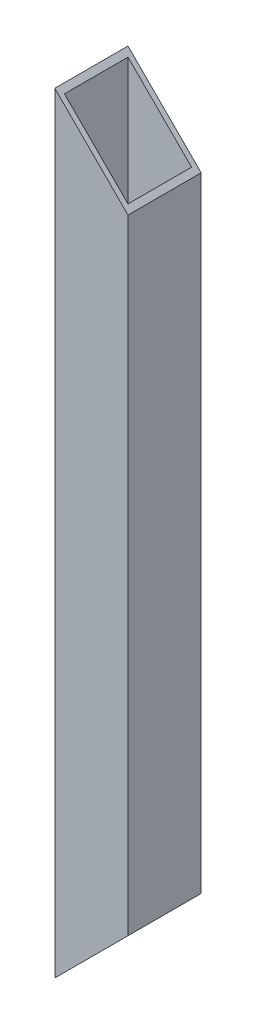
ISO-10303-21;
HEADER;
FILE_DESCRIPTION(('STEP AP214'),'2;1');
FILE_NAME('part.step','',(''),(''),'','','');
FILE_SCHEMA(('AUTOMOTIVE_DESIGN { 1 0 10303 214 1 1 1 1 }'));
ENDSEC;
DATA;
#1=APPLICATION_CONTEXT('core data for automotive mechanical design processes');
#2=APPLICATION_PROTOCOL_DEFINITION('international standard','automotive_design',2000,#1);
#3=PRODUCT_CONTEXT('',#1,'mechanical');
#4=PRODUCT('Part','Part','',(#3));
#5=PRODUCT_RELATED_PRODUCT_CATEGORY('part','',(#4));
#6=PRODUCT_DEFINITION_FORMATION('','',#4);
#7=PRODUCT_DEFINITION_CONTEXT('part definition',#1,'design');
#8=PRODUCT_DEFINITION('design','',#6,#7);
#9=PRODUCT_DEFINITION_SHAPE('','',#8);
#10=(LENGTH_UNIT() NAMED_UNIT(*) SI_UNIT(.MILLI.,.METRE.));
#11=(NAMED_UNIT(*) PLANE_ANGLE_UNIT() SI_UNIT($,.RADIAN.));
#12=(NAMED_UNIT(*) SI_UNIT($,.STERADIAN.) SOLID_ANGLE_UNIT());
#13=UNCERTAINTY_MEASURE_WITH_UNIT(LENGTH_MEASURE(1.E-05),#10,'distance_accuracy_value','');
#14=(GEOMETRIC_REPRESENTATION_CONTEXT(3) GLOBAL_UNCERTAINTY_ASSIGNED_CONTEXT((#13)) GLOBAL_UNIT_ASSIGNED_CONTEXT((#10,
#11,#12)) REPRESENTATION_CONTEXT('',''));
#15=CARTESIAN_POINT('',(0.,0.,0.));
#16=DIRECTION('',(0.,0.,1.));
#17=DIRECTION('',(1.,0.,0.));
#18=AXIS2_PLACEMENT_3D('',#15,#16,#17);
#19=CARTESIAN_POINT('',(19.,400.,-19.));
#20=DIRECTION('',(1.,0.,0.));
#21=DIRECTION('',(0.,0.,-1.));
#22=AXIS2_PLACEMENT_3D('',#19,#20,#21);
#23=PLANE('',#22);
#24=DIRECTION('',(0.,0.,1.));
#25=VECTOR('',#24,1.);
#26=CARTESIAN_POINT('',(19.,362.,-384.593855255503));
#27=LINE('',#26,#25);
#28=CARTESIAN_POINT('',(19.,362.,-19.));
#29=VERTEX_POINT('',#28);
#30=CARTESIAN_POINT('',(19.,362.,19.));
#31=VERTEX_POINT('',#30);
#32=EDGE_CURVE('E97',#29,#31,#27,.T.);
#33=ORIENTED_EDGE('',*,*,#32,.T.);
#34=DIRECTION('',(0.,-1.,0.));
#35=VECTOR('',#34,1.);
#36=CARTESIAN_POINT('',(19.,400.,19.));
#37=LINE('',#36,#35);
#38=CARTESIAN_POINT('',(19.,38.,19.));
#39=VERTEX_POINT('',#38);
#40=EDGE_CURVE('E95',#31,#39,#37,.T.);
#41=ORIENTED_EDGE('',*,*,#40,.T.);
#42=DIRECTION('',(0.,0.,1.));
#43=VECTOR('',#42,1.);
#44=CARTESIAN_POINT('',(19.,38.,-384.593855255503));
#45=LINE('',#44,#43);
#46=CARTESIAN_POINT('',(19.,38.,-19.));
#47=VERTEX_POINT('',#46);
#48=EDGE_CURVE('E137',#47,#39,#45,.T.);
#49=ORIENTED_EDGE('',*,*,#48,.F.);
#50=DIRECTION('',(0.,-1.,0.));
#51=VECTOR('',#50,1.);
#52=CARTESIAN_POINT('',(19.,400.,-19.));
#53=LINE('',#52,#51);
#54=EDGE_CURVE('E85',#29,#47,#53,.T.);
#55=ORIENTED_EDGE('',*,*,#54,.F.);
#56=EDGE_LOOP('',(#33,#41,#49,#55));
#57=FACE_BOUND('',#56,.T.);
#58=ADVANCED_FACE('F17',(#57),#23,.T.);
#59=CARTESIAN_POINT('',(19.,400.,19.));
#60=DIRECTION('',(0.,0.,1.));
#61=DIRECTION('',(1.,0.,0.));
#62=AXIS2_PLACEMENT_3D('',#59,#60,#61);
#63=PLANE('',#62);
#64=DIRECTION('',(0.707106781186547,-0.707106781186548,0.));
#65=VECTOR('',#64,1.);
#66=CARTESIAN_POINT('',(-19.,400.,19.));
#67=LINE('',#66,#65);
#68=CARTESIAN_POINT('',(-19.,400.,19.));
#69=VERTEX_POINT('',#68);
#70=EDGE_CURVE('E31',#69,#31,#67,.T.);
#71=ORIENTED_EDGE('',*,*,#70,.F.);
#72=DIRECTION('',(0.,-1.,0.));
#73=VECTOR('',#72,1.);
#74=CARTESIAN_POINT('',(-19.,400.,19.));
#75=LINE('',#74,#73);
#76=CARTESIAN_POINT('',(-19.,0.,19.));
#77=VERTEX_POINT('',#76);
#78=EDGE_CURVE('E93',#69,#77,#75,.T.);
#79=ORIENTED_EDGE('',*,*,#78,.T.);
#80=DIRECTION('',(0.707106781186547,0.707106781186548,0.));
#81=VECTOR('',#80,1.);
#82=CARTESIAN_POINT('',(-19.,0.,19.));
#83=LINE('',#82,#81);
#84=EDGE_CURVE('E134',#77,#39,#83,.T.);
#85=ORIENTED_EDGE('',*,*,#84,.T.);
#86=ORIENTED_EDGE('',*,*,#40,.F.);
#87=EDGE_LOOP('',(#71,#79,#85,#86));
#88=FACE_BOUND('',#87,.T.);
#89=ADVANCED_FACE('F91',(#88),#63,.T.);
#90=CARTESIAN_POINT('',(-19.,400.,-19.));
#91=DIRECTION('',(0.,0.,-1.));
#92=DIRECTION('',(-1.,0.,0.));
#93=AXIS2_PLACEMENT_3D('',#90,#91,#92);
#94=PLANE('',#93);
#95=DIRECTION('',(-0.707106781186547,0.707106781186548,0.));
#96=VECTOR('',#95,1.);
#97=CARTESIAN_POINT('',(-19.,400.,-19.));
#98=LINE('',#97,#96);
#99=CARTESIAN_POINT('',(-19.,400.,-19.));
#100=VERTEX_POINT('',#99);
#101=EDGE_CURVE('E80',#29,#100,#98,.T.);
#102=ORIENTED_EDGE('',*,*,#101,.F.);
#103=ORIENTED_EDGE('',*,*,#54,.T.);
#104=DIRECTION('',(-0.707106781186547,-0.707106781186548,0.));
#105=VECTOR('',#104,1.);
#106=CARTESIAN_POINT('',(181.,200.,-19.));
#107=LINE('',#106,#105);
#108=CARTESIAN_POINT('',(-19.,0.,-19.));
#109=VERTEX_POINT('',#108);
#110=EDGE_CURVE('E145',#47,#109,#107,.T.);
#111=ORIENTED_EDGE('',*,*,#110,.T.);
#112=DIRECTION('',(0.,-1.,0.));
#113=VECTOR('',#112,1.);
#114=CARTESIAN_POINT('',(-19.,400.,-19.));
#115=LINE('',#114,#113);
#116=EDGE_CURVE('E100',#100,#109,#115,.T.);
#117=ORIENTED_EDGE('',*,*,#116,.F.);
#118=EDGE_LOOP('',(#102,#103,#111,#117));
#119=FACE_BOUND('',#118,.T.);
#120=ADVANCED_FACE('F152',(#119),#94,.T.);
#121=CARTESIAN_POINT('',(-19.,400.,19.));
#122=DIRECTION('',(-1.,0.,0.));
#123=DIRECTION('',(0.,0.,1.));
#124=AXIS2_PLACEMENT_3D('',#121,#122,#123);
#125=PLANE('',#124);
#126=DIRECTION('',(0.,0.,-1.));
#127=VECTOR('',#126,1.);
#128=CARTESIAN_POINT('',(-19.,0.,19.));
#129=LINE('',#128,#127);
#130=EDGE_CURVE('E86',#77,#109,#129,.T.);
#131=ORIENTED_EDGE('',*,*,#130,.F.);
#132=ORIENTED_EDGE('',*,*,#78,.F.);
#133=DIRECTION('',(0.,0.,-1.));
#134=VECTOR('',#133,1.);
#135=CARTESIAN_POINT('',(-19.,400.,19.));
#136=LINE('',#135,#134);
#137=EDGE_CURVE('E77',#69,#100,#136,.T.);
#138=ORIENTED_EDGE('',*,*,#137,.T.);
#139=ORIENTED_EDGE('',*,*,#116,.T.);
#140=EDGE_LOOP('',(#131,#132,#138,#139));
#141=FACE_BOUND('',#140,.T.);
#142=ADVANCED_FACE('F99',(#141),#125,.T.);
#143=CARTESIAN_POINT('',(-19.,0.,-384.593855255503));
#144=DIRECTION('',(0.707106781186548,-0.707106781186547,0.));
#145=DIRECTION('',(0.707106781186547,0.707106781186548,0.));
#146=AXIS2_PLACEMENT_3D('',#143,#144,#145);
#147=PLANE('',#146);
#148=DIRECTION('',(0.707106781186547,0.707106781186548,0.));
#149=VECTOR('',#148,1.);
#150=CARTESIAN_POINT('',(-19.,0.,-16.5));
#151=LINE('',#150,#149);
#152=CARTESIAN_POINT('',(-16.5,2.5,-16.5));
#153=VERTEX_POINT('',#152);
#154=CARTESIAN_POINT('',(16.5,35.5,-16.5));
#155=VERTEX_POINT('',#154);
#156=EDGE_CURVE('E24',#153,#155,#151,.T.);
#157=ORIENTED_EDGE('',*,*,#156,.F.);
#158=DIRECTION('',(0.,0.,-1.));
#159=VECTOR('',#158,1.);
#160=CARTESIAN_POINT('',(-16.5,2.5,-384.593855255503));
#161=LINE('',#160,#159);
#162=CARTESIAN_POINT('',(-16.5,2.5,16.5));
#163=VERTEX_POINT('',#162);
#164=EDGE_CURVE('E102',#163,#153,#161,.T.);
#165=ORIENTED_EDGE('',*,*,#164,.F.);
#166=DIRECTION('',(-0.707106781186547,-0.707106781186548,0.));
#167=VECTOR('',#166,1.);
#168=CARTESIAN_POINT('',(-19.,0.,16.5));
#169=LINE('',#168,#167);
#170=CARTESIAN_POINT('',(16.5,35.5,16.5));
#171=VERTEX_POINT('',#170);
#172=EDGE_CURVE('E109',#171,#163,#169,.T.);
#173=ORIENTED_EDGE('',*,*,#172,.F.);
#174=DIRECTION('',(0.,0.,1.));
#175=VECTOR('',#174,1.);
#176=CARTESIAN_POINT('',(16.5,35.5,-384.593855255503));
#177=LINE('',#176,#175);
#178=EDGE_CURVE('E112',#155,#171,#177,.T.);
#179=ORIENTED_EDGE('',*,*,#178,.F.);
#180=EDGE_LOOP('',(#157,#165,#173,#179));
#181=FACE_BOUND('',#180,.T.);
#182=ORIENTED_EDGE('',*,*,#48,.T.);
#183=ORIENTED_EDGE('',*,*,#84,.F.);
#184=ORIENTED_EDGE('',*,*,#130,.T.);
#185=ORIENTED_EDGE('',*,*,#110,.F.);
#186=EDGE_LOOP('',(#182,#183,#184,#185));
#187=FACE_BOUND('',#186,.T.);
#188=ADVANCED_FACE('F126',(#181,#187),#147,.T.);
#189=CARTESIAN_POINT('',(-16.5,403.593855255503,-16.5));
#190=DIRECTION('',(0.,0.,-1.));
#191=DIRECTION('',(-1.,0.,0.));
#192=AXIS2_PLACEMENT_3D('',#189,#190,#191);
#193=PLANE('',#192);
#194=DIRECTION('',(0.,-1.,0.));
#195=VECTOR('',#194,1.);
#196=CARTESIAN_POINT('',(16.5,403.593855255503,-16.5));
#197=LINE('',#196,#195);
#198=CARTESIAN_POINT('',(16.5,364.5,-16.5));
#199=VERTEX_POINT('',#198);
#200=EDGE_CURVE('E120',#199,#155,#197,.T.);
#201=ORIENTED_EDGE('',*,*,#200,.F.);
#202=DIRECTION('',(-0.707106781186547,0.707106781186548,0.));
#203=VECTOR('',#202,1.);
#204=CARTESIAN_POINT('',(-19.5469276277516,400.546927627752,-16.5));
#205=LINE('',#204,#203);
#206=CARTESIAN_POINT('',(-16.5,397.5,-16.5));
#207=VERTEX_POINT('',#206);
#208=EDGE_CURVE('E161',#199,#207,#205,.T.);
#209=ORIENTED_EDGE('',*,*,#208,.T.);
#210=DIRECTION('',(0.,-1.,0.));
#211=VECTOR('',#210,1.);
#212=CARTESIAN_POINT('',(-16.5,403.593855255503,-16.5));
#213=LINE('',#212,#211);
#214=EDGE_CURVE('E122',#207,#153,#213,.T.);
#215=ORIENTED_EDGE('',*,*,#214,.T.);
#216=ORIENTED_EDGE('',*,*,#156,.T.);
#217=EDGE_LOOP('',(#201,#209,#215,#216));
#218=FACE_BOUND('',#217,.T.);
#219=ADVANCED_FACE('F119',(#218),#193,.F.);
#220=CARTESIAN_POINT('',(16.5,403.593855255503,-16.5));
#221=DIRECTION('',(1.,0.,0.));
#222=DIRECTION('',(0.,0.,-1.));
#223=AXIS2_PLACEMENT_3D('',#220,#221,#222);
#224=PLANE('',#223);
#225=DIRECTION('',(0.,-1.,0.));
#226=VECTOR('',#225,1.);
#227=CARTESIAN_POINT('',(16.5,403.593855255503,16.5));
#228=LINE('',#227,#226);
#229=CARTESIAN_POINT('',(16.5,364.5,16.5));
#230=VERTEX_POINT('',#229);
#231=EDGE_CURVE('E132',#230,#171,#228,.T.);
#232=ORIENTED_EDGE('',*,*,#231,.F.);
#233=DIRECTION('',(0.,0.,-1.));
#234=VECTOR('',#233,1.);
#235=CARTESIAN_POINT('',(16.5,364.5,-16.5));
#236=LINE('',#235,#234);
#237=EDGE_CURVE('E133',#230,#199,#236,.T.);
#238=ORIENTED_EDGE('',*,*,#237,.T.);
#239=ORIENTED_EDGE('',*,*,#200,.T.);
#240=ORIENTED_EDGE('',*,*,#178,.T.);
#241=EDGE_LOOP('',(#232,#238,#239,#240));
#242=FACE_BOUND('',#241,.T.);
#243=ADVANCED_FACE('F130',(#242),#224,.F.);
#244=CARTESIAN_POINT('',(16.5,403.593855255503,16.5));
#245=DIRECTION('',(0.,0.,1.));
#246=DIRECTION('',(1.,0.,0.));
#247=AXIS2_PLACEMENT_3D('',#244,#245,#246);
#248=PLANE('',#247);
#249=DIRECTION('',(0.,-1.,0.));
#250=VECTOR('',#249,1.);
#251=CARTESIAN_POINT('',(-16.5,403.593855255503,16.5));
#252=LINE('',#251,#250);
#253=CARTESIAN_POINT('',(-16.5,397.5,16.5));
#254=VERTEX_POINT('',#253);
#255=EDGE_CURVE('E139',#254,#163,#252,.T.);
#256=ORIENTED_EDGE('',*,*,#255,.F.);
#257=DIRECTION('',(0.707106781186547,-0.707106781186548,0.));
#258=VECTOR('',#257,1.);
#259=CARTESIAN_POINT('',(-3.04692762775159,384.046927627751,16.5));
#260=LINE('',#259,#258);
#261=EDGE_CURVE('E155',#254,#230,#260,.T.);
#262=ORIENTED_EDGE('',*,*,#261,.T.);
#263=ORIENTED_EDGE('',*,*,#231,.T.);
#264=ORIENTED_EDGE('',*,*,#172,.T.);
#265=EDGE_LOOP('',(#256,#262,#263,#264));
#266=FACE_BOUND('',#265,.T.);
#267=ADVANCED_FACE('F168',(#266),#248,.F.);
#268=CARTESIAN_POINT('',(-16.5,403.593855255503,16.5));
#269=DIRECTION('',(-1.,0.,0.));
#270=DIRECTION('',(0.,0.,1.));
#271=AXIS2_PLACEMENT_3D('',#268,#269,#270);
#272=PLANE('',#271);
#273=ORIENTED_EDGE('',*,*,#214,.F.);
#274=DIRECTION('',(0.,0.,1.));
#275=VECTOR('',#274,1.);
#276=CARTESIAN_POINT('',(-16.5,397.5,16.5));
#277=LINE('',#276,#275);
#278=EDGE_CURVE('E11',#207,#254,#277,.T.);
#279=ORIENTED_EDGE('',*,*,#278,.T.);
#280=ORIENTED_EDGE('',*,*,#255,.T.);
#281=ORIENTED_EDGE('',*,*,#164,.T.);
#282=EDGE_LOOP('',(#273,#279,#280,#281));
#283=FACE_BOUND('',#282,.T.);
#284=ADVANCED_FACE('F166',(#283),#272,.F.);
#285=CARTESIAN_POINT('',(-19.,400.,-384.593855255503));
#286=DIRECTION('',(-0.707106781186548,-0.707106781186547,0.));
#287=DIRECTION('',(0.707106781186547,-0.707106781186548,0.));
#288=AXIS2_PLACEMENT_3D('',#285,#286,#287);
#289=PLANE('',#288);
#290=ORIENTED_EDGE('',*,*,#237,.F.);
#291=ORIENTED_EDGE('',*,*,#261,.F.);
#292=ORIENTED_EDGE('',*,*,#278,.F.);
#293=ORIENTED_EDGE('',*,*,#208,.F.);
#294=EDGE_LOOP('',(#290,#291,#292,#293));
#295=FACE_BOUND('',#294,.T.);
#296=ORIENTED_EDGE('',*,*,#101,.T.);
#297=ORIENTED_EDGE('',*,*,#137,.F.);
#298=ORIENTED_EDGE('',*,*,#70,.T.);
#299=ORIENTED_EDGE('',*,*,#32,.F.);
#300=EDGE_LOOP('',(#296,#297,#298,#299));
#301=FACE_BOUND('',#300,.T.);
#302=ADVANCED_FACE('F78',(#295,#301),#289,.F.);
#303=CLOSED_SHELL('',(#58,#89,#120,#142,#188,#219,#243,#267,#284,#302));
#304=MANIFOLD_SOLID_BREP('B1',#303);
#305=ADVANCED_BREP_SHAPE_REPRESENTATION('',(#18,#304),#14);
#306=SHAPE_DEFINITION_REPRESENTATION(#9,#305);
ENDSEC;
END-ISO-10303-21;
